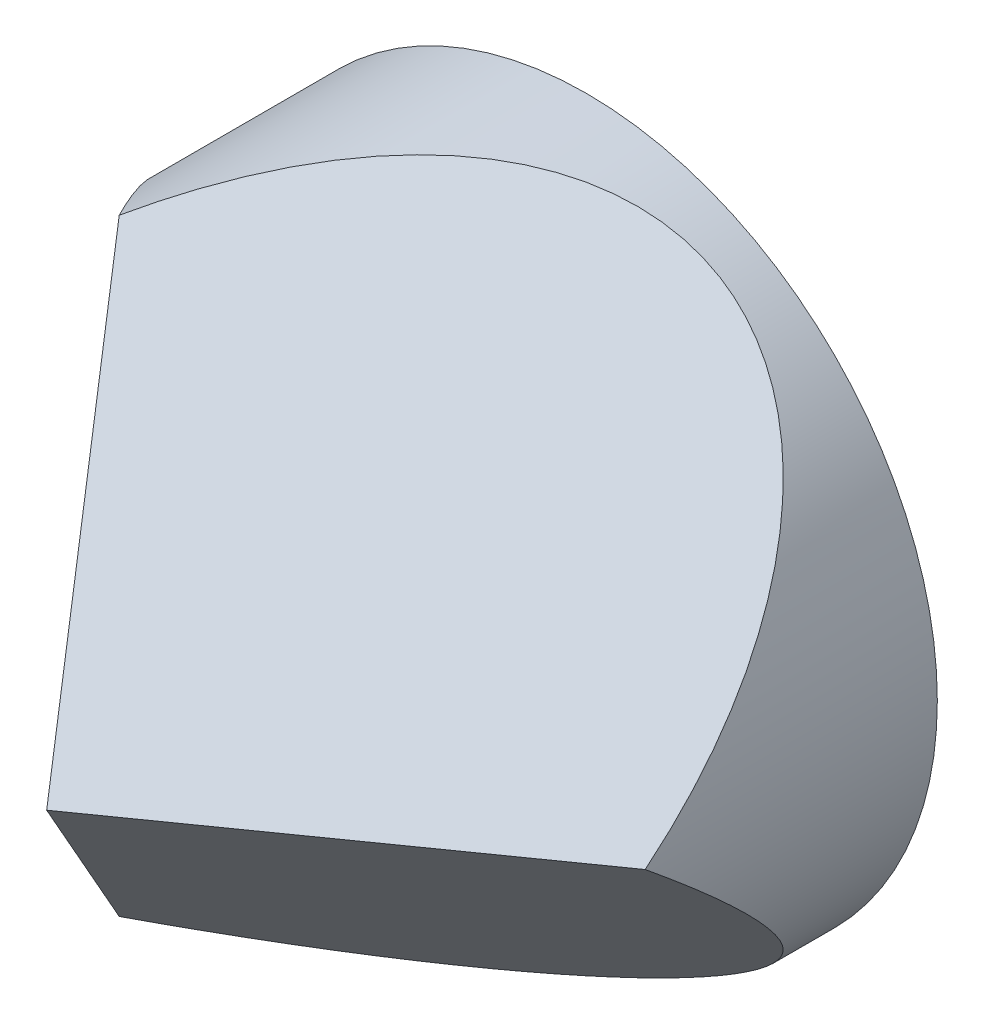
ISO-10303-21;
HEADER;
FILE_DESCRIPTION(('STEP AP214'),'2;1');
FILE_NAME('part.step','',(''),(''),'','','');
FILE_SCHEMA(('AUTOMOTIVE_DESIGN { 1 0 10303 214 1 1 1 1 }'));
ENDSEC;
DATA;
#1=APPLICATION_CONTEXT('core data for automotive mechanical design processes');
#2=APPLICATION_PROTOCOL_DEFINITION('international standard','automotive_design',2000,#1);
#3=PRODUCT_CONTEXT('',#1,'mechanical');
#4=PRODUCT('Part','Part','',(#3));
#5=PRODUCT_RELATED_PRODUCT_CATEGORY('part','',(#4));
#6=PRODUCT_DEFINITION_FORMATION('','',#4);
#7=PRODUCT_DEFINITION_CONTEXT('part definition',#1,'design');
#8=PRODUCT_DEFINITION('design','',#6,#7);
#9=PRODUCT_DEFINITION_SHAPE('','',#8);
#10=(LENGTH_UNIT() NAMED_UNIT(*) SI_UNIT(.MILLI.,.METRE.));
#11=(NAMED_UNIT(*) PLANE_ANGLE_UNIT() SI_UNIT($,.RADIAN.));
#12=(NAMED_UNIT(*) SI_UNIT($,.STERADIAN.) SOLID_ANGLE_UNIT());
#13=UNCERTAINTY_MEASURE_WITH_UNIT(LENGTH_MEASURE(1.E-05),#10,'distance_accuracy_value','');
#14=(GEOMETRIC_REPRESENTATION_CONTEXT(3) GLOBAL_UNCERTAINTY_ASSIGNED_CONTEXT((#13)) GLOBAL_UNIT_ASSIGNED_CONTEXT((#10,
#11,#12)) REPRESENTATION_CONTEXT('',''));
#15=CARTESIAN_POINT('',(0.,0.,0.));
#16=DIRECTION('',(0.,0.,1.));
#17=DIRECTION('',(1.,0.,0.));
#18=AXIS2_PLACEMENT_3D('',#15,#16,#17);
#19=CARTESIAN_POINT('',(0.,0.,47.9));
#20=DIRECTION('',(0.,0.,-1.));
#21=DIRECTION('',(-1.,0.,0.));
#22=AXIS2_PLACEMENT_3D('',#19,#20,#21);
#23=CYLINDRICAL_SURFACE('',#22,31.1);
#24=CARTESIAN_POINT('',(0.,0.,0.));
#25=DIRECTION('',(0.,0.,1.));
#26=DIRECTION('',(1.,0.,0.));
#27=AXIS2_PLACEMENT_3D('',#24,#25,#26);
#28=CIRCLE('',#27,31.1);
#29=CARTESIAN_POINT('',(31.1,0.,0.));
#30=VERTEX_POINT('',#29);
#31=EDGE_CURVE('E73',#30,#30,#28,.T.);
#32=ORIENTED_EDGE('',*,*,#31,.T.);
#33=EDGE_LOOP('',(#32));
#34=FACE_BOUND('',#33,.T.);
#35=CARTESIAN_POINT('',(0.,0.,47.9));
#36=DIRECTION('',(0.408220021868278,0.70705781854274,0.577430216548671));
#37=DIRECTION('',(0.288715108274334,0.5000692364439,-0.816440043736559));
#38=AXIS2_PLACEMENT_3D('',#35,#36,#37);
#39=ELLIPSE('',#38,53.8593220595317,31.1);
#40=CARTESIAN_POINT('',(31.1,0.,25.9135463710473));
#41=VERTEX_POINT('',#40);
#42=CARTESIAN_POINT('',(-15.55,26.933390057696,25.9135463710472));
#43=VERTEX_POINT('',#42);
#44=EDGE_CURVE('E72',#41,#43,#39,.T.);
#45=ORIENTED_EDGE('',*,*,#44,.F.);
#46=CARTESIAN_POINT('',(0.,0.,47.9));
#47=DIRECTION('',(-0.408220021868278,0.70705781854274,-0.577430216548671));
#48=DIRECTION('',(0.288715108274334,-0.500069236443899,-0.816440043736559));
#49=AXIS2_PLACEMENT_3D('',#46,#47,#48);
#50=ELLIPSE('',#49,53.8593220595317,31.1);
#51=CARTESIAN_POINT('',(-15.55,-26.933390057696,25.9135463710472));
#52=VERTEX_POINT('',#51);
#53=EDGE_CURVE('E50',#41,#52,#50,.T.);
#54=ORIENTED_EDGE('',*,*,#53,.T.);
#55=CARTESIAN_POINT('',(0.,0.,47.9));
#56=DIRECTION('',(0.816440043736559,0.,-0.577430216548671));
#57=DIRECTION('',(-0.577430216548671,0.,-0.816440043736559));
#58=AXIS2_PLACEMENT_3D('',#55,#56,#57);
#59=ELLIPSE('',#58,53.8593220595317,31.1);
#60=EDGE_CURVE('E57',#52,#43,#59,.T.);
#61=ORIENTED_EDGE('',*,*,#60,.T.);
#62=EDGE_LOOP('',(#45,#54,#61));
#63=FACE_BOUND('',#62,.T.);
#64=ADVANCED_FACE('F37',(#34,#63),#23,.T.);
#65=CARTESIAN_POINT('',(0.,-39.5,47.9));
#66=DIRECTION('',(0.816440043736559,0.,-0.577430216548671));
#67=DIRECTION('',(-0.577430216548671,0.,-0.816440043736559));
#68=AXIS2_PLACEMENT_3D('',#65,#66,#67);
#69=PLANE('',#68);
#70=ORIENTED_EDGE('',*,*,#60,.F.);
#71=DIRECTION('',(0.408276553188406,0.707155733661414,0.577270321830581));
#72=VECTOR('',#71,1.);
#73=CARTESIAN_POINT('',(-11.4042466675147,-19.7527346501834,31.7753092907749));
#74=LINE('',#73,#72);
#75=CARTESIAN_POINT('',(0.,0.,47.9));
#76=VERTEX_POINT('',#75);
#77=EDGE_CURVE('E64',#52,#76,#74,.T.);
#78=ORIENTED_EDGE('',*,*,#77,.T.);
#79=DIRECTION('',(0.408276553188406,-0.707155733661414,0.577270321830581));
#80=VECTOR('',#79,1.);
#81=CARTESIAN_POINT('',(11.4042466675147,-19.7527346501834,64.0246907092251));
#82=LINE('',#81,#80);
#83=EDGE_CURVE('E44',#43,#76,#82,.T.);
#84=ORIENTED_EDGE('',*,*,#83,.F.);
#85=EDGE_LOOP('',(#70,#78,#84));
#86=FACE_BOUND('',#85,.T.);
#87=ADVANCED_FACE('F69',(#86),#69,.F.);
#88=CARTESIAN_POINT('',(0.,0.,0.));
#89=DIRECTION('',(0.,0.,1.));
#90=DIRECTION('',(1.,0.,0.));
#91=AXIS2_PLACEMENT_3D('',#88,#89,#90);
#92=PLANE('',#91);
#93=ORIENTED_EDGE('',*,*,#31,.F.);
#94=EDGE_LOOP('',(#93));
#95=FACE_BOUND('',#94,.T.);
#96=ADVANCED_FACE('F84',(#95),#92,.F.);
#97=CARTESIAN_POINT('',(53.6935750346353,-30.9999999999999,47.9));
#98=DIRECTION('',(0.408220021868278,0.70705781854274,0.577430216548671));
#99=DIRECTION('',(0.,-0.632534350546001,0.774532307511668));
#100=AXIS2_PLACEMENT_3D('',#97,#98,#99);
#101=PLANE('',#100);
#102=DIRECTION('',(-0.816553106376811,0.,0.577270321830579));
#103=VECTOR('',#102,1.);
#104=CARTESIAN_POINT('',(35.800673082831,0.,22.590358886786));
#105=LINE('',#104,#103);
#106=EDGE_CURVE('E11',#41,#76,#105,.T.);
#107=ORIENTED_EDGE('',*,*,#106,.F.);
#108=ORIENTED_EDGE('',*,*,#44,.T.);
#109=ORIENTED_EDGE('',*,*,#83,.T.);
#110=EDGE_LOOP('',(#107,#108,#109));
#111=FACE_BOUND('',#110,.T.);
#112=ADVANCED_FACE('F71',(#111),#101,.T.);
#113=CARTESIAN_POINT('',(46.3323591024675,26.7499999999999,47.9));
#114=DIRECTION('',(-0.408220021868278,0.70705781854274,-0.577430216548671));
#115=DIRECTION('',(0.,0.632534350546001,0.774532307511668));
#116=AXIS2_PLACEMENT_3D('',#113,#114,#115);
#117=PLANE('',#116);
#118=ORIENTED_EDGE('',*,*,#106,.T.);
#119=ORIENTED_EDGE('',*,*,#77,.F.);
#120=ORIENTED_EDGE('',*,*,#53,.F.);
#121=EDGE_LOOP('',(#118,#119,#120));
#122=FACE_BOUND('',#121,.T.);
#123=ADVANCED_FACE('F63',(#122),#117,.F.);
#124=CLOSED_SHELL('',(#64,#87,#96,#112,#123));
#125=MANIFOLD_SOLID_BREP('B2',#124);
#126=ADVANCED_BREP_SHAPE_REPRESENTATION('',(#18,#125),#14);
#127=SHAPE_DEFINITION_REPRESENTATION(#9,#126);
ENDSEC;
END-ISO-10303-21;
